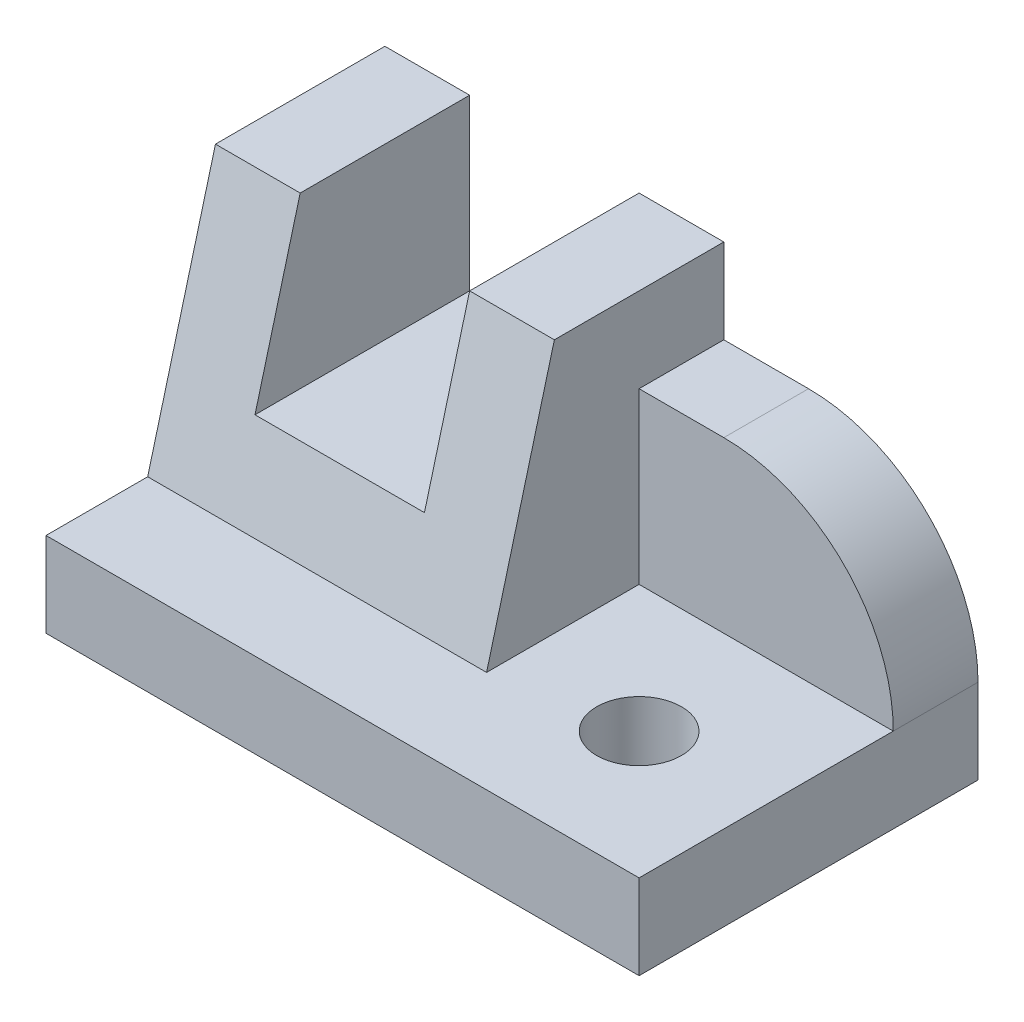
ISO-10303-21;
HEADER;
FILE_DESCRIPTION(('STEP AP214'),'2;1');
FILE_NAME('part.step','',(''),(''),'','','');
FILE_SCHEMA(('AUTOMOTIVE_DESIGN { 1 0 10303 214 1 1 1 1 }'));
ENDSEC;
DATA;
#1=APPLICATION_CONTEXT('core data for automotive mechanical design processes');
#2=APPLICATION_PROTOCOL_DEFINITION('international standard','automotive_design',2000,#1);
#3=PRODUCT_CONTEXT('',#1,'mechanical');
#4=PRODUCT('Part','Part','',(#3));
#5=PRODUCT_RELATED_PRODUCT_CATEGORY('part','',(#4));
#6=PRODUCT_DEFINITION_FORMATION('','',#4);
#7=PRODUCT_DEFINITION_CONTEXT('part definition',#1,'design');
#8=PRODUCT_DEFINITION('design','',#6,#7);
#9=PRODUCT_DEFINITION_SHAPE('','',#8);
#10=(LENGTH_UNIT() NAMED_UNIT(*) SI_UNIT(.MILLI.,.METRE.));
#11=(NAMED_UNIT(*) PLANE_ANGLE_UNIT() SI_UNIT($,.RADIAN.));
#12=(NAMED_UNIT(*) SI_UNIT($,.STERADIAN.) SOLID_ANGLE_UNIT());
#13=UNCERTAINTY_MEASURE_WITH_UNIT(LENGTH_MEASURE(1.E-05),#10,'distance_accuracy_value','');
#14=(GEOMETRIC_REPRESENTATION_CONTEXT(3) GLOBAL_UNCERTAINTY_ASSIGNED_CONTEXT((#13)) GLOBAL_UNIT_ASSIGNED_CONTEXT((#10,
#11,#12)) REPRESENTATION_CONTEXT('',''));
#15=CARTESIAN_POINT('',(0.,0.,0.));
#16=DIRECTION('',(0.,0.,1.));
#17=DIRECTION('',(1.,0.,0.));
#18=AXIS2_PLACEMENT_3D('',#15,#16,#17);
#19=CARTESIAN_POINT('',(40.,40.,-40.));
#20=DIRECTION('',(0.,-1.,0.));
#21=DIRECTION('',(0.,0.,-1.));
#22=AXIS2_PLACEMENT_3D('',#19,#20,#21);
#23=PLANE('',#22);
#24=DIRECTION('',(-1.,0.,0.));
#25=VECTOR('',#24,1.);
#26=CARTESIAN_POINT('',(40.,40.,-20.));
#27=LINE('',#26,#25);
#28=CARTESIAN_POINT('',(9.99999999999998,40.,-20.));
#29=VERTEX_POINT('',#28);
#30=CARTESIAN_POINT('',(0.,40.,-20.));
#31=VERTEX_POINT('',#30);
#32=EDGE_CURVE('E235',#29,#31,#27,.T.);
#33=ORIENTED_EDGE('',*,*,#32,.F.);
#34=DIRECTION('',(0.,0.,-1.));
#35=VECTOR('',#34,1.);
#36=CARTESIAN_POINT('',(9.99999999999998,40.,0.));
#37=LINE('',#36,#35);
#38=CARTESIAN_POINT('',(9.99999999999999,40.,-40.));
#39=VERTEX_POINT('',#38);
#40=EDGE_CURVE('E160',#29,#39,#37,.T.);
#41=ORIENTED_EDGE('',*,*,#40,.T.);
#42=DIRECTION('',(1.,0.,0.));
#43=VECTOR('',#42,1.);
#44=CARTESIAN_POINT('',(40.,40.,-40.));
#45=LINE('',#44,#43);
#46=CARTESIAN_POINT('',(0.,40.,-40.));
#47=VERTEX_POINT('',#46);
#48=EDGE_CURVE('E219',#47,#39,#45,.T.);
#49=ORIENTED_EDGE('',*,*,#48,.F.);
#50=DIRECTION('',(0.,0.,1.));
#51=VECTOR('',#50,1.);
#52=CARTESIAN_POINT('',(0.,40.,-40.));
#53=LINE('',#52,#51);
#54=EDGE_CURVE('E221',#47,#31,#53,.T.);
#55=ORIENTED_EDGE('',*,*,#54,.T.);
#56=EDGE_LOOP('',(#33,#41,#49,#55));
#57=FACE_BOUND('',#56,.T.);
#58=ADVANCED_FACE('F35',(#57),#23,.F.);
#59=CARTESIAN_POINT('',(40.,10.,-12.));
#60=DIRECTION('',(0.,0.257662650560332,0.966234939601246));
#61=DIRECTION('',(0.,-0.966234939601246,0.257662650560332));
#62=AXIS2_PLACEMENT_3D('',#59,#60,#61);
#63=PLANE('',#62);
#64=DIRECTION('',(0.,-0.966234939601246,0.257662650560332));
#65=VECTOR('',#64,1.);
#66=CARTESIAN_POINT('',(9.99999999999998,10.,-12.));
#67=LINE('',#66,#65);
#68=CARTESIAN_POINT('',(9.99999999999998,20.,-14.6666666666667));
#69=VERTEX_POINT('',#68);
#70=EDGE_CURVE('E168',#29,#69,#67,.T.);
#71=ORIENTED_EDGE('',*,*,#70,.F.);
#72=ORIENTED_EDGE('',*,*,#32,.T.);
#73=DIRECTION('',(0.,0.966234939601246,-0.257662650560332));
#74=VECTOR('',#73,1.);
#75=CARTESIAN_POINT('',(0.,10.,-12.));
#76=LINE('',#75,#74);
#77=CARTESIAN_POINT('',(0.,10.,-12.));
#78=VERTEX_POINT('',#77);
#79=EDGE_CURVE('E224',#78,#31,#76,.T.);
#80=ORIENTED_EDGE('',*,*,#79,.F.);
#81=DIRECTION('',(-1.,0.,0.));
#82=VECTOR('',#81,1.);
#83=CARTESIAN_POINT('',(40.,10.,-12.));
#84=LINE('',#83,#82);
#85=CARTESIAN_POINT('',(40.,10.,-12.));
#86=VERTEX_POINT('',#85);
#87=EDGE_CURVE('E228',#86,#78,#84,.T.);
#88=ORIENTED_EDGE('',*,*,#87,.F.);
#89=DIRECTION('',(0.,0.966234939601246,-0.257662650560332));
#90=VECTOR('',#89,1.);
#91=CARTESIAN_POINT('',(40.,10.,-12.));
#92=LINE('',#91,#90);
#93=CARTESIAN_POINT('',(40.,40.,-20.));
#94=VERTEX_POINT('',#93);
#95=EDGE_CURVE('E225',#86,#94,#92,.T.);
#96=ORIENTED_EDGE('',*,*,#95,.T.);
#97=CARTESIAN_POINT('',(30.,40.,-20.));
#98=VERTEX_POINT('',#97);
#99=EDGE_CURVE('E231',#94,#98,#27,.T.);
#100=ORIENTED_EDGE('',*,*,#99,.T.);
#101=DIRECTION('',(0.,0.966234939601246,-0.257662650560332));
#102=VECTOR('',#101,1.);
#103=CARTESIAN_POINT('',(30.,10.,-12.));
#104=LINE('',#103,#102);
#105=CARTESIAN_POINT('',(30.,20.,-14.6666666666667));
#106=VERTEX_POINT('',#105);
#107=EDGE_CURVE('E163',#106,#98,#104,.T.);
#108=ORIENTED_EDGE('',*,*,#107,.F.);
#109=DIRECTION('',(1.,0.,0.));
#110=VECTOR('',#109,1.);
#111=CARTESIAN_POINT('',(40.,20.,-14.6666666666667));
#112=LINE('',#111,#110);
#113=EDGE_CURVE('E140',#69,#106,#112,.T.);
#114=ORIENTED_EDGE('',*,*,#113,.F.);
#115=EDGE_LOOP('',(#71,#72,#80,#88,#96,#100,#108,#114));
#116=FACE_BOUND('',#115,.T.);
#117=ADVANCED_FACE('F270',(#116),#63,.T.);
#118=CARTESIAN_POINT('',(0.,0.,0.));
#119=DIRECTION('',(1.,0.,0.));
#120=DIRECTION('',(0.,0.,-1.));
#121=AXIS2_PLACEMENT_3D('',#118,#119,#120);
#122=PLANE('',#121);
#123=DIRECTION('',(0.,1.,0.));
#124=VECTOR('',#123,1.);
#125=CARTESIAN_POINT('',(0.,40.,-40.));
#126=LINE('',#125,#124);
#127=CARTESIAN_POINT('',(0.,0.,-40.));
#128=VERTEX_POINT('',#127);
#129=EDGE_CURVE('E216',#128,#47,#126,.T.);
#130=ORIENTED_EDGE('',*,*,#129,.F.);
#131=DIRECTION('',(0.,0.,-1.));
#132=VECTOR('',#131,1.);
#133=CARTESIAN_POINT('',(0.,0.,-40.));
#134=LINE('',#133,#132);
#135=CARTESIAN_POINT('',(0.,0.,0.));
#136=VERTEX_POINT('',#135);
#137=EDGE_CURVE('E174',#136,#128,#134,.T.);
#138=ORIENTED_EDGE('',*,*,#137,.F.);
#139=DIRECTION('',(0.,1.,0.));
#140=VECTOR('',#139,1.);
#141=CARTESIAN_POINT('',(0.,0.,0.));
#142=LINE('',#141,#140);
#143=CARTESIAN_POINT('',(0.,10.,0.));
#144=VERTEX_POINT('',#143);
#145=EDGE_CURVE('E192',#136,#144,#142,.T.);
#146=ORIENTED_EDGE('',*,*,#145,.T.);
#147=DIRECTION('',(0.,0.,-1.));
#148=VECTOR('',#147,1.);
#149=CARTESIAN_POINT('',(0.,10.,-40.));
#150=LINE('',#149,#148);
#151=EDGE_CURVE('E186',#144,#78,#150,.T.);
#152=ORIENTED_EDGE('',*,*,#151,.T.);
#153=ORIENTED_EDGE('',*,*,#79,.T.);
#154=ORIENTED_EDGE('',*,*,#54,.F.);
#155=EDGE_LOOP('',(#130,#138,#146,#152,#153,#154));
#156=FACE_BOUND('',#155,.T.);
#157=ADVANCED_FACE('F273',(#156),#122,.F.);
#158=CARTESIAN_POINT('',(30.,40.,-40.));
#159=VERTEX_POINT('',#158);
#160=CARTESIAN_POINT('',(40.,40.,-40.));
#161=VERTEX_POINT('',#160);
#162=EDGE_CURVE('E218',#159,#161,#45,.T.);
#163=ORIENTED_EDGE('',*,*,#162,.F.);
#164=DIRECTION('',(0.,0.,-1.));
#165=VECTOR('',#164,1.);
#166=CARTESIAN_POINT('',(30.,40.,0.));
#167=LINE('',#166,#165);
#168=EDGE_CURVE('E144',#98,#159,#167,.T.);
#169=ORIENTED_EDGE('',*,*,#168,.F.);
#170=ORIENTED_EDGE('',*,*,#99,.F.);
#171=DIRECTION('',(0.,0.,1.));
#172=VECTOR('',#171,1.);
#173=CARTESIAN_POINT('',(40.,40.,-40.));
#174=LINE('',#173,#172);
#175=EDGE_CURVE('E195',#161,#94,#174,.T.);
#176=ORIENTED_EDGE('',*,*,#175,.F.);
#177=EDGE_LOOP('',(#163,#169,#170,#176));
#178=FACE_BOUND('',#177,.T.);
#179=ADVANCED_FACE('F267',(#178),#23,.F.);
#180=CARTESIAN_POINT('',(0.,0.,-40.));
#181=DIRECTION('',(0.,0.,1.));
#182=DIRECTION('',(0.,-1.,0.));
#183=AXIS2_PLACEMENT_3D('',#180,#181,#182);
#184=PLANE('',#183);
#185=DIRECTION('',(1.,0.,0.));
#186=VECTOR('',#185,1.);
#187=CARTESIAN_POINT('',(40.,30.,-40.));
#188=LINE('',#187,#186);
#189=CARTESIAN_POINT('',(40.,30.,-40.));
#190=VERTEX_POINT('',#189);
#191=CARTESIAN_POINT('',(50.,30.,-40.));
#192=VERTEX_POINT('',#191);
#193=EDGE_CURVE('E209',#190,#192,#188,.T.);
#194=ORIENTED_EDGE('',*,*,#193,.T.);
#195=CARTESIAN_POINT('',(50.,9.99999999999999,-40.));
#196=DIRECTION('',(0.,0.,1.));
#197=DIRECTION('',(0.,-1.,0.));
#198=AXIS2_PLACEMENT_3D('',#195,#196,#197);
#199=CIRCLE('',#198,20.);
#200=CARTESIAN_POINT('',(70.,10.,-40.));
#201=VERTEX_POINT('',#200);
#202=EDGE_CURVE('E50',#192,#201,#199,.F.);
#203=ORIENTED_EDGE('',*,*,#202,.T.);
#204=DIRECTION('',(0.,1.,0.));
#205=VECTOR('',#204,1.);
#206=CARTESIAN_POINT('',(70.,40.,-40.));
#207=LINE('',#206,#205);
#208=CARTESIAN_POINT('',(70.,0.,-40.));
#209=VERTEX_POINT('',#208);
#210=EDGE_CURVE('E211',#209,#201,#207,.T.);
#211=ORIENTED_EDGE('',*,*,#210,.F.);
#212=DIRECTION('',(1.,0.,0.));
#213=VECTOR('',#212,1.);
#214=CARTESIAN_POINT('',(70.,0.,-40.));
#215=LINE('',#214,#213);
#216=EDGE_CURVE('E178',#128,#209,#215,.T.);
#217=ORIENTED_EDGE('',*,*,#216,.F.);
#218=ORIENTED_EDGE('',*,*,#129,.T.);
#219=ORIENTED_EDGE('',*,*,#48,.T.);
#220=DIRECTION('',(0.,1.,0.));
#221=VECTOR('',#220,1.);
#222=CARTESIAN_POINT('',(9.99999999999999,20.,-40.));
#223=LINE('',#222,#221);
#224=CARTESIAN_POINT('',(9.99999999999999,20.,-40.));
#225=VERTEX_POINT('',#224);
#226=EDGE_CURVE('E155',#225,#39,#223,.T.);
#227=ORIENTED_EDGE('',*,*,#226,.F.);
#228=DIRECTION('',(-1.,0.,0.));
#229=VECTOR('',#228,1.);
#230=CARTESIAN_POINT('',(30.,20.,-40.));
#231=LINE('',#230,#229);
#232=CARTESIAN_POINT('',(30.,20.,-40.));
#233=VERTEX_POINT('',#232);
#234=EDGE_CURVE('E137',#233,#225,#231,.T.);
#235=ORIENTED_EDGE('',*,*,#234,.F.);
#236=DIRECTION('',(0.,-1.,0.));
#237=VECTOR('',#236,1.);
#238=CARTESIAN_POINT('',(30.,40.,-40.));
#239=LINE('',#238,#237);
#240=EDGE_CURVE('E147',#159,#233,#239,.T.);
#241=ORIENTED_EDGE('',*,*,#240,.F.);
#242=ORIENTED_EDGE('',*,*,#162,.T.);
#243=DIRECTION('',(0.,1.,0.));
#244=VECTOR('',#243,1.);
#245=CARTESIAN_POINT('',(40.,30.,-40.));
#246=LINE('',#245,#244);
#247=EDGE_CURVE('E205',#190,#161,#246,.T.);
#248=ORIENTED_EDGE('',*,*,#247,.F.);
#249=EDGE_LOOP('',(#194,#203,#211,#217,#218,#219,#227,#235,#241,#242,#248));
#250=FACE_BOUND('',#249,.T.);
#251=ADVANCED_FACE('F153',(#250),#184,.F.);
#252=CARTESIAN_POINT('',(70.,0.,0.));
#253=DIRECTION('',(-1.,0.,0.));
#254=DIRECTION('',(0.,0.,1.));
#255=AXIS2_PLACEMENT_3D('',#252,#253,#254);
#256=PLANE('',#255);
#257=ORIENTED_EDGE('',*,*,#210,.T.);
#258=DIRECTION('',(0.,0.,-1.));
#259=VECTOR('',#258,1.);
#260=CARTESIAN_POINT('',(70.,9.99999999999999,0.));
#261=LINE('',#260,#259);
#262=CARTESIAN_POINT('',(70.,10.,-30.));
#263=VERTEX_POINT('',#262);
#264=EDGE_CURVE('E43',#201,#263,#261,.F.);
#265=ORIENTED_EDGE('',*,*,#264,.T.);
#266=DIRECTION('',(0.,0.,1.));
#267=VECTOR('',#266,1.);
#268=CARTESIAN_POINT('',(70.,10.,0.));
#269=LINE('',#268,#267);
#270=CARTESIAN_POINT('',(70.,10.,0.));
#271=VERTEX_POINT('',#270);
#272=EDGE_CURVE('E175',#263,#271,#269,.T.);
#273=ORIENTED_EDGE('',*,*,#272,.T.);
#274=DIRECTION('',(0.,1.,0.));
#275=VECTOR('',#274,1.);
#276=CARTESIAN_POINT('',(70.,0.,0.));
#277=LINE('',#276,#275);
#278=CARTESIAN_POINT('',(70.,0.,0.));
#279=VERTEX_POINT('',#278);
#280=EDGE_CURVE('E183',#279,#271,#277,.T.);
#281=ORIENTED_EDGE('',*,*,#280,.F.);
#282=DIRECTION('',(0.,0.,1.));
#283=VECTOR('',#282,1.);
#284=CARTESIAN_POINT('',(70.,0.,0.));
#285=LINE('',#284,#283);
#286=EDGE_CURVE('E181',#209,#279,#285,.T.);
#287=ORIENTED_EDGE('',*,*,#286,.F.);
#288=EDGE_LOOP('',(#257,#265,#273,#281,#287));
#289=FACE_BOUND('',#288,.T.);
#290=ADVANCED_FACE('F245',(#289),#256,.F.);
#291=CARTESIAN_POINT('',(40.,30.,-30.));
#292=DIRECTION('',(0.,-1.,0.));
#293=DIRECTION('',(0.,0.,-1.));
#294=AXIS2_PLACEMENT_3D('',#291,#292,#293);
#295=PLANE('',#294);
#296=DIRECTION('',(1.,0.,0.));
#297=VECTOR('',#296,1.);
#298=CARTESIAN_POINT('',(40.,30.,-30.));
#299=LINE('',#298,#297);
#300=CARTESIAN_POINT('',(40.,30.,-30.));
#301=VERTEX_POINT('',#300);
#302=CARTESIAN_POINT('',(50.,30.,-30.));
#303=VERTEX_POINT('',#302);
#304=EDGE_CURVE('E212',#301,#303,#299,.T.);
#305=ORIENTED_EDGE('',*,*,#304,.T.);
#306=DIRECTION('',(0.,0.,-1.));
#307=VECTOR('',#306,1.);
#308=CARTESIAN_POINT('',(50.,30.,-30.));
#309=LINE('',#308,#307);
#310=EDGE_CURVE('E234',#303,#192,#309,.T.);
#311=ORIENTED_EDGE('',*,*,#310,.T.);
#312=ORIENTED_EDGE('',*,*,#193,.F.);
#313=DIRECTION('',(0.,0.,-1.));
#314=VECTOR('',#313,1.);
#315=CARTESIAN_POINT('',(40.,30.,-30.));
#316=LINE('',#315,#314);
#317=EDGE_CURVE('E202',#301,#190,#316,.T.);
#318=ORIENTED_EDGE('',*,*,#317,.F.);
#319=EDGE_LOOP('',(#305,#311,#312,#318));
#320=FACE_BOUND('',#319,.T.);
#321=ADVANCED_FACE('F259',(#320),#295,.F.);
#322=CARTESIAN_POINT('',(40.,10.,-30.));
#323=DIRECTION('',(0.,0.,-1.));
#324=DIRECTION('',(-1.,0.,0.));
#325=AXIS2_PLACEMENT_3D('',#322,#323,#324);
#326=PLANE('',#325);
#327=DIRECTION('',(1.,0.,0.));
#328=VECTOR('',#327,1.);
#329=CARTESIAN_POINT('',(40.,10.,-30.));
#330=LINE('',#329,#328);
#331=CARTESIAN_POINT('',(40.,10.,-30.));
#332=VERTEX_POINT('',#331);
#333=EDGE_CURVE('E208',#332,#263,#330,.T.);
#334=ORIENTED_EDGE('',*,*,#333,.T.);
#335=CARTESIAN_POINT('',(50.,9.99999999999999,-30.));
#336=DIRECTION('',(0.,0.,-1.));
#337=DIRECTION('',(-1.,0.,0.));
#338=AXIS2_PLACEMENT_3D('',#335,#336,#337);
#339=CIRCLE('',#338,20.);
#340=EDGE_CURVE('E11',#263,#303,#339,.F.);
#341=ORIENTED_EDGE('',*,*,#340,.T.);
#342=ORIENTED_EDGE('',*,*,#304,.F.);
#343=DIRECTION('',(0.,1.,0.));
#344=VECTOR('',#343,1.);
#345=CARTESIAN_POINT('',(40.,10.,-30.));
#346=LINE('',#345,#344);
#347=EDGE_CURVE('E199',#332,#301,#346,.T.);
#348=ORIENTED_EDGE('',*,*,#347,.F.);
#349=EDGE_LOOP('',(#334,#341,#342,#348));
#350=FACE_BOUND('',#349,.T.);
#351=ADVANCED_FACE('F252',(#350),#326,.F.);
#352=CARTESIAN_POINT('',(40.,0.,0.));
#353=DIRECTION('',(-1.,0.,0.));
#354=DIRECTION('',(0.,0.,1.));
#355=AXIS2_PLACEMENT_3D('',#352,#353,#354);
#356=PLANE('',#355);
#357=ORIENTED_EDGE('',*,*,#95,.F.);
#358=DIRECTION('',(0.,0.,-1.));
#359=VECTOR('',#358,1.);
#360=CARTESIAN_POINT('',(40.,10.,0.));
#361=LINE('',#360,#359);
#362=EDGE_CURVE('E197',#86,#332,#361,.T.);
#363=ORIENTED_EDGE('',*,*,#362,.T.);
#364=ORIENTED_EDGE('',*,*,#347,.T.);
#365=ORIENTED_EDGE('',*,*,#317,.T.);
#366=ORIENTED_EDGE('',*,*,#247,.T.);
#367=ORIENTED_EDGE('',*,*,#175,.T.);
#368=EDGE_LOOP('',(#357,#363,#364,#365,#366,#367));
#369=FACE_BOUND('',#368,.T.);
#370=ADVANCED_FACE('F264',(#369),#356,.F.);
#371=CARTESIAN_POINT('',(0.,10.,0.));
#372=DIRECTION('',(0.,1.,0.));
#373=DIRECTION('',(0.,0.,1.));
#374=AXIS2_PLACEMENT_3D('',#371,#372,#373);
#375=PLANE('',#374);
#376=CARTESIAN_POINT('',(55.,10.,-15.));
#377=DIRECTION('',(0.,1.,0.));
#378=DIRECTION('',(0.,0.,1.));
#379=AXIS2_PLACEMENT_3D('',#376,#377,#378);
#380=CIRCLE('',#379,4.99999999999998);
#381=CARTESIAN_POINT('',(55.,10.,-10.));
#382=VERTEX_POINT('',#381);
#383=EDGE_CURVE('E151',#382,#382,#380,.T.);
#384=ORIENTED_EDGE('',*,*,#383,.F.);
#385=EDGE_LOOP('',(#384));
#386=FACE_BOUND('',#385,.T.);
#387=ORIENTED_EDGE('',*,*,#333,.F.);
#388=ORIENTED_EDGE('',*,*,#362,.F.);
#389=ORIENTED_EDGE('',*,*,#87,.T.);
#390=ORIENTED_EDGE('',*,*,#151,.F.);
#391=DIRECTION('',(-1.,0.,0.));
#392=VECTOR('',#391,1.);
#393=CARTESIAN_POINT('',(0.,10.,0.));
#394=LINE('',#393,#392);
#395=EDGE_CURVE('E170',#271,#144,#394,.T.);
#396=ORIENTED_EDGE('',*,*,#395,.F.);
#397=ORIENTED_EDGE('',*,*,#272,.F.);
#398=EDGE_LOOP('',(#387,#388,#389,#390,#396,#397));
#399=FACE_BOUND('',#398,.T.);
#400=ADVANCED_FACE('F256',(#386,#399),#375,.T.);
#401=CARTESIAN_POINT('',(0.,0.,0.));
#402=DIRECTION('',(0.,0.,-1.));
#403=DIRECTION('',(-1.,0.,0.));
#404=AXIS2_PLACEMENT_3D('',#401,#402,#403);
#405=PLANE('',#404);
#406=ORIENTED_EDGE('',*,*,#395,.T.);
#407=ORIENTED_EDGE('',*,*,#145,.F.);
#408=DIRECTION('',(-1.,0.,0.));
#409=VECTOR('',#408,1.);
#410=CARTESIAN_POINT('',(0.,0.,0.));
#411=LINE('',#410,#409);
#412=EDGE_CURVE('E171',#279,#136,#411,.T.);
#413=ORIENTED_EDGE('',*,*,#412,.F.);
#414=ORIENTED_EDGE('',*,*,#280,.T.);
#415=EDGE_LOOP('',(#406,#407,#413,#414));
#416=FACE_BOUND('',#415,.T.);
#417=ADVANCED_FACE('F278',(#416),#405,.F.);
#418=CARTESIAN_POINT('',(0.,0.,0.));
#419=DIRECTION('',(0.,1.,0.));
#420=DIRECTION('',(0.,0.,1.));
#421=AXIS2_PLACEMENT_3D('',#418,#419,#420);
#422=PLANE('',#421);
#423=CARTESIAN_POINT('',(55.,0.,-15.));
#424=DIRECTION('',(0.,-1.,0.));
#425=DIRECTION('',(0.,0.,-1.));
#426=AXIS2_PLACEMENT_3D('',#423,#424,#425);
#427=CIRCLE('',#426,4.99999999999998);
#428=CARTESIAN_POINT('',(55.,0.,-20.));
#429=VERTEX_POINT('',#428);
#430=EDGE_CURVE('E240',#429,#429,#427,.T.);
#431=ORIENTED_EDGE('',*,*,#430,.F.);
#432=EDGE_LOOP('',(#431));
#433=FACE_BOUND('',#432,.T.);
#434=ORIENTED_EDGE('',*,*,#412,.T.);
#435=ORIENTED_EDGE('',*,*,#137,.T.);
#436=ORIENTED_EDGE('',*,*,#216,.T.);
#437=ORIENTED_EDGE('',*,*,#286,.T.);
#438=EDGE_LOOP('',(#434,#435,#436,#437));
#439=FACE_BOUND('',#438,.T.);
#440=ADVANCED_FACE('F280',(#433,#439),#422,.F.);
#441=CARTESIAN_POINT('',(9.99999999999998,20.,0.));
#442=DIRECTION('',(-1.,0.,0.));
#443=DIRECTION('',(0.,0.,1.));
#444=AXIS2_PLACEMENT_3D('',#441,#442,#443);
#445=PLANE('',#444);
#446=ORIENTED_EDGE('',*,*,#70,.T.);
#447=DIRECTION('',(0.,0.,-1.));
#448=VECTOR('',#447,1.);
#449=CARTESIAN_POINT('',(9.99999999999998,20.,0.));
#450=LINE('',#449,#448);
#451=EDGE_CURVE('E143',#69,#225,#450,.T.);
#452=ORIENTED_EDGE('',*,*,#451,.T.);
#453=ORIENTED_EDGE('',*,*,#226,.T.);
#454=ORIENTED_EDGE('',*,*,#40,.F.);
#455=EDGE_LOOP('',(#446,#452,#453,#454));
#456=FACE_BOUND('',#455,.T.);
#457=ADVANCED_FACE('F286',(#456),#445,.F.);
#458=CARTESIAN_POINT('',(30.,20.,0.));
#459=DIRECTION('',(0.,-1.,0.));
#460=DIRECTION('',(0.,0.,-1.));
#461=AXIS2_PLACEMENT_3D('',#458,#459,#460);
#462=PLANE('',#461);
#463=ORIENTED_EDGE('',*,*,#113,.T.);
#464=DIRECTION('',(0.,0.,-1.));
#465=VECTOR('',#464,1.);
#466=CARTESIAN_POINT('',(30.,20.,0.));
#467=LINE('',#466,#465);
#468=EDGE_CURVE('E132',#106,#233,#467,.T.);
#469=ORIENTED_EDGE('',*,*,#468,.T.);
#470=ORIENTED_EDGE('',*,*,#234,.T.);
#471=ORIENTED_EDGE('',*,*,#451,.F.);
#472=EDGE_LOOP('',(#463,#469,#470,#471));
#473=FACE_BOUND('',#472,.T.);
#474=ADVANCED_FACE('F134',(#473),#462,.F.);
#475=CARTESIAN_POINT('',(30.,40.,0.));
#476=DIRECTION('',(1.,0.,0.));
#477=DIRECTION('',(0.,0.,-1.));
#478=AXIS2_PLACEMENT_3D('',#475,#476,#477);
#479=PLANE('',#478);
#480=ORIENTED_EDGE('',*,*,#107,.T.);
#481=ORIENTED_EDGE('',*,*,#168,.T.);
#482=ORIENTED_EDGE('',*,*,#240,.T.);
#483=ORIENTED_EDGE('',*,*,#468,.F.);
#484=EDGE_LOOP('',(#480,#481,#482,#483));
#485=FACE_BOUND('',#484,.T.);
#486=ADVANCED_FACE('F148',(#485),#479,.F.);
#487=CARTESIAN_POINT('',(55.,0.,-15.));
#488=DIRECTION('',(0.,-1.,0.));
#489=DIRECTION('',(0.,0.,-1.));
#490=AXIS2_PLACEMENT_3D('',#487,#488,#489);
#491=CYLINDRICAL_SURFACE('',#490,4.99999999999998);
#492=ORIENTED_EDGE('',*,*,#383,.T.);
#493=EDGE_LOOP('',(#492));
#494=FACE_BOUND('',#493,.T.);
#495=ORIENTED_EDGE('',*,*,#430,.T.);
#496=EDGE_LOOP('',(#495));
#497=FACE_BOUND('',#496,.T.);
#498=ADVANCED_FACE('F346',(#494,#497),#491,.F.);
#499=CARTESIAN_POINT('',(50.,9.99999999999999,-30.));
#500=DIRECTION('',(0.,0.,-1.));
#501=DIRECTION('',(-1.,0.,0.));
#502=AXIS2_PLACEMENT_3D('',#499,#500,#501);
#503=CYLINDRICAL_SURFACE('',#502,20.);
#504=ORIENTED_EDGE('',*,*,#340,.F.);
#505=ORIENTED_EDGE('',*,*,#264,.F.);
#506=ORIENTED_EDGE('',*,*,#202,.F.);
#507=ORIENTED_EDGE('',*,*,#310,.F.);
#508=EDGE_LOOP('',(#504,#505,#506,#507));
#509=FACE_BOUND('',#508,.T.);
#510=ADVANCED_FACE('F37',(#509),#503,.T.);
#511=CLOSED_SHELL('',(#58,#117,#157,#179,#251,#290,#321,#351,#370,#400,#417,#440,#457,#474,#486,
#498,#510));
#512=MANIFOLD_SOLID_BREP('B2',#511);
#513=ADVANCED_BREP_SHAPE_REPRESENTATION('',(#18,#512),#14);
#514=SHAPE_DEFINITION_REPRESENTATION(#9,#513);
ENDSEC;
END-ISO-10303-21;
